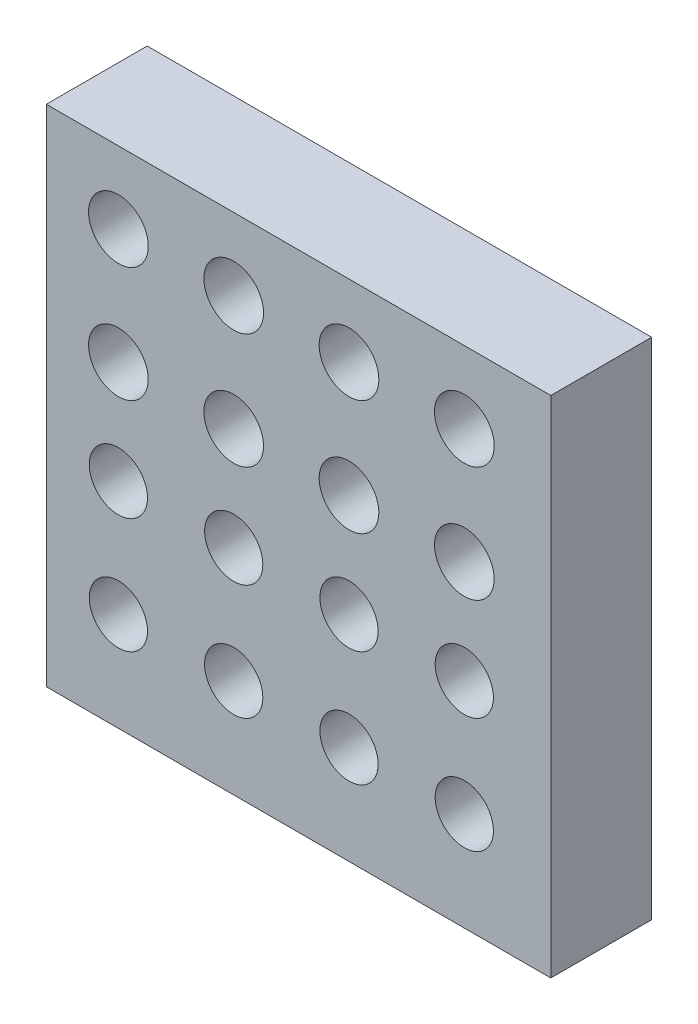
ISO-10303-21;
HEADER;
FILE_DESCRIPTION(('STEP AP214'),'2;1');
FILE_NAME('part.step','',(''),(''),'','','');
FILE_SCHEMA(('AUTOMOTIVE_DESIGN { 1 0 10303 214 1 1 1 1 }'));
ENDSEC;
DATA;
#1=APPLICATION_CONTEXT('core data for automotive mechanical design processes');
#2=APPLICATION_PROTOCOL_DEFINITION('international standard','automotive_design',2000,#1);
#3=PRODUCT_CONTEXT('',#1,'mechanical');
#4=PRODUCT('Part','Part','',(#3));
#5=PRODUCT_RELATED_PRODUCT_CATEGORY('part','',(#4));
#6=PRODUCT_DEFINITION_FORMATION('','',#4);
#7=PRODUCT_DEFINITION_CONTEXT('part definition',#1,'design');
#8=PRODUCT_DEFINITION('design','',#6,#7);
#9=PRODUCT_DEFINITION_SHAPE('','',#8);
#10=(LENGTH_UNIT() NAMED_UNIT(*) SI_UNIT(.MILLI.,.METRE.));
#11=(NAMED_UNIT(*) PLANE_ANGLE_UNIT() SI_UNIT($,.RADIAN.));
#12=(NAMED_UNIT(*) SI_UNIT($,.STERADIAN.) SOLID_ANGLE_UNIT());
#13=UNCERTAINTY_MEASURE_WITH_UNIT(LENGTH_MEASURE(1.E-05),#10,'distance_accuracy_value','');
#14=(GEOMETRIC_REPRESENTATION_CONTEXT(3) GLOBAL_UNCERTAINTY_ASSIGNED_CONTEXT((#13)) GLOBAL_UNIT_ASSIGNED_CONTEXT((#10,
#11,#12)) REPRESENTATION_CONTEXT('',''));
#15=CARTESIAN_POINT('',(0.,0.,0.));
#16=DIRECTION('',(0.,0.,1.));
#17=DIRECTION('',(1.,0.,0.));
#18=AXIS2_PLACEMENT_3D('',#15,#16,#17);
#19=CARTESIAN_POINT('',(0.,0.,7.));
#20=DIRECTION('',(1.,0.,0.));
#21=DIRECTION('',(0.,1.,0.));
#22=AXIS2_PLACEMENT_3D('',#19,#20,#21);
#23=PLANE('',#22);
#24=DIRECTION('',(0.,-1.,0.));
#25=VECTOR('',#24,1.);
#26=CARTESIAN_POINT('',(0.,0.,0.));
#27=LINE('',#26,#25);
#28=CARTESIAN_POINT('',(0.,0.,0.));
#29=VERTEX_POINT('',#28);
#30=CARTESIAN_POINT('',(0.,-35.,0.));
#31=VERTEX_POINT('',#30);
#32=EDGE_CURVE('E113',#29,#31,#27,.T.);
#33=ORIENTED_EDGE('',*,*,#32,.T.);
#34=DIRECTION('',(0.,0.,-1.));
#35=VECTOR('',#34,1.);
#36=CARTESIAN_POINT('',(0.,-35.,7.));
#37=LINE('',#36,#35);
#38=CARTESIAN_POINT('',(0.,-35.,7.));
#39=VERTEX_POINT('',#38);
#40=EDGE_CURVE('E11',#39,#31,#37,.T.);
#41=ORIENTED_EDGE('',*,*,#40,.F.);
#42=DIRECTION('',(0.,-1.,0.));
#43=VECTOR('',#42,1.);
#44=CARTESIAN_POINT('',(0.,0.,7.));
#45=LINE('',#44,#43);
#46=CARTESIAN_POINT('',(0.,0.,7.));
#47=VERTEX_POINT('',#46);
#48=EDGE_CURVE('E97',#47,#39,#45,.T.);
#49=ORIENTED_EDGE('',*,*,#48,.F.);
#50=DIRECTION('',(0.,0.,-1.));
#51=VECTOR('',#50,1.);
#52=CARTESIAN_POINT('',(0.,0.,7.));
#53=LINE('',#52,#51);
#54=EDGE_CURVE('E109',#47,#29,#53,.T.);
#55=ORIENTED_EDGE('',*,*,#54,.T.);
#56=EDGE_LOOP('',(#33,#41,#49,#55));
#57=FACE_BOUND('',#56,.T.);
#58=ADVANCED_FACE('F45',(#57),#23,.F.);
#59=CARTESIAN_POINT('',(0.,-35.,7.));
#60=DIRECTION('',(0.,1.,0.));
#61=DIRECTION('',(0.,0.,1.));
#62=AXIS2_PLACEMENT_3D('',#59,#60,#61);
#63=PLANE('',#62);
#64=DIRECTION('',(1.,0.,0.));
#65=VECTOR('',#64,1.);
#66=CARTESIAN_POINT('',(0.,-35.,0.));
#67=LINE('',#66,#65);
#68=CARTESIAN_POINT('',(35.,-35.,0.));
#69=VERTEX_POINT('',#68);
#70=EDGE_CURVE('E102',#31,#69,#67,.T.);
#71=ORIENTED_EDGE('',*,*,#70,.T.);
#72=DIRECTION('',(0.,0.,-1.));
#73=VECTOR('',#72,1.);
#74=CARTESIAN_POINT('',(35.,-35.,7.));
#75=LINE('',#74,#73);
#76=CARTESIAN_POINT('',(35.,-35.,7.));
#77=VERTEX_POINT('',#76);
#78=EDGE_CURVE('E54',#77,#69,#75,.T.);
#79=ORIENTED_EDGE('',*,*,#78,.F.);
#80=DIRECTION('',(1.,0.,0.));
#81=VECTOR('',#80,1.);
#82=CARTESIAN_POINT('',(0.,-35.,7.));
#83=LINE('',#82,#81);
#84=EDGE_CURVE('E92',#39,#77,#83,.T.);
#85=ORIENTED_EDGE('',*,*,#84,.F.);
#86=ORIENTED_EDGE('',*,*,#40,.T.);
#87=EDGE_LOOP('',(#71,#79,#85,#86));
#88=FACE_BOUND('',#87,.T.);
#89=ADVANCED_FACE('F101',(#88),#63,.F.);
#90=CARTESIAN_POINT('',(35.,0.,7.));
#91=DIRECTION('',(-1.,0.,0.));
#92=DIRECTION('',(0.,-1.,0.));
#93=AXIS2_PLACEMENT_3D('',#90,#91,#92);
#94=PLANE('',#93);
#95=DIRECTION('',(0.,1.,0.));
#96=VECTOR('',#95,1.);
#97=CARTESIAN_POINT('',(35.,0.,0.));
#98=LINE('',#97,#96);
#99=CARTESIAN_POINT('',(35.,0.,0.));
#100=VERTEX_POINT('',#99);
#101=EDGE_CURVE('E79',#69,#100,#98,.T.);
#102=ORIENTED_EDGE('',*,*,#101,.T.);
#103=DIRECTION('',(0.,0.,-1.));
#104=VECTOR('',#103,1.);
#105=CARTESIAN_POINT('',(35.,0.,7.));
#106=LINE('',#105,#104);
#107=CARTESIAN_POINT('',(35.,0.,7.));
#108=VERTEX_POINT('',#107);
#109=EDGE_CURVE('E104',#108,#100,#106,.T.);
#110=ORIENTED_EDGE('',*,*,#109,.F.);
#111=DIRECTION('',(0.,1.,0.));
#112=VECTOR('',#111,1.);
#113=CARTESIAN_POINT('',(35.,0.,7.));
#114=LINE('',#113,#112);
#115=EDGE_CURVE('E95',#77,#108,#114,.T.);
#116=ORIENTED_EDGE('',*,*,#115,.F.);
#117=ORIENTED_EDGE('',*,*,#78,.T.);
#118=EDGE_LOOP('',(#102,#110,#116,#117));
#119=FACE_BOUND('',#118,.T.);
#120=ADVANCED_FACE('F105',(#119),#94,.F.);
#121=CARTESIAN_POINT('',(0.,0.,7.));
#122=DIRECTION('',(0.,-1.,0.));
#123=DIRECTION('',(0.,0.,-1.));
#124=AXIS2_PLACEMENT_3D('',#121,#122,#123);
#125=PLANE('',#124);
#126=DIRECTION('',(-1.,0.,0.));
#127=VECTOR('',#126,1.);
#128=CARTESIAN_POINT('',(0.,0.,0.));
#129=LINE('',#128,#127);
#130=EDGE_CURVE('E85',#100,#29,#129,.T.);
#131=ORIENTED_EDGE('',*,*,#130,.T.);
#132=ORIENTED_EDGE('',*,*,#54,.F.);
#133=DIRECTION('',(-1.,0.,0.));
#134=VECTOR('',#133,1.);
#135=CARTESIAN_POINT('',(0.,0.,7.));
#136=LINE('',#135,#134);
#137=EDGE_CURVE('E62',#108,#47,#136,.T.);
#138=ORIENTED_EDGE('',*,*,#137,.F.);
#139=ORIENTED_EDGE('',*,*,#109,.T.);
#140=EDGE_LOOP('',(#131,#132,#138,#139));
#141=FACE_BOUND('',#140,.T.);
#142=ADVANCED_FACE('F127',(#141),#125,.F.);
#143=CARTESIAN_POINT('',(0.,0.,7.));
#144=DIRECTION('',(0.,0.,1.));
#145=DIRECTION('',(1.,0.,0.));
#146=AXIS2_PLACEMENT_3D('',#143,#144,#145);
#147=PLANE('',#146);
#148=CARTESIAN_POINT('',(13.0000000000001,-13.,7.));
#149=DIRECTION('',(0.,0.,1.));
#150=DIRECTION('',(1.,0.,0.));
#151=AXIS2_PLACEMENT_3D('',#148,#149,#150);
#152=CIRCLE('',#151,2.07);
#153=CARTESIAN_POINT('',(15.0700000000001,-13.,7.));
#154=VERTEX_POINT('',#153);
#155=EDGE_CURVE('E147',#154,#154,#152,.T.);
#156=ORIENTED_EDGE('',*,*,#155,.F.);
#157=EDGE_LOOP('',(#156));
#158=FACE_BOUND('',#157,.T.);
#159=CARTESIAN_POINT('',(21.0000000000001,-13.,7.));
#160=DIRECTION('',(0.,0.,1.));
#161=DIRECTION('',(1.,0.,0.));
#162=AXIS2_PLACEMENT_3D('',#159,#160,#161);
#163=CIRCLE('',#162,2.07);
#164=CARTESIAN_POINT('',(23.0700000000001,-13.,7.));
#165=VERTEX_POINT('',#164);
#166=EDGE_CURVE('E178',#165,#165,#163,.T.);
#167=ORIENTED_EDGE('',*,*,#166,.F.);
#168=EDGE_LOOP('',(#167));
#169=FACE_BOUND('',#168,.T.);
#170=CARTESIAN_POINT('',(29.0000000000001,-13.,7.));
#171=DIRECTION('',(0.,0.,1.));
#172=DIRECTION('',(1.,0.,0.));
#173=AXIS2_PLACEMENT_3D('',#170,#171,#172);
#174=CIRCLE('',#173,2.07);
#175=CARTESIAN_POINT('',(31.0700000000001,-13.,7.));
#176=VERTEX_POINT('',#175);
#177=EDGE_CURVE('E179',#176,#176,#174,.T.);
#178=ORIENTED_EDGE('',*,*,#177,.F.);
#179=EDGE_LOOP('',(#178));
#180=FACE_BOUND('',#179,.T.);
#181=CARTESIAN_POINT('',(5.00000000000008,-20.1498357522851,7.));
#182=DIRECTION('',(0.,0.,1.));
#183=DIRECTION('',(1.,0.,0.));
#184=AXIS2_PLACEMENT_3D('',#181,#182,#183);
#185=CIRCLE('',#184,2.02);
#186=CARTESIAN_POINT('',(7.02000000000008,-20.1498357522851,7.));
#187=VERTEX_POINT('',#186);
#188=EDGE_CURVE('E194',#187,#187,#185,.T.);
#189=ORIENTED_EDGE('',*,*,#188,.F.);
#190=EDGE_LOOP('',(#189));
#191=FACE_BOUND('',#190,.T.);
#192=CARTESIAN_POINT('',(29.,-5.,7.));
#193=DIRECTION('',(0.,0.,1.));
#194=DIRECTION('',(1.,0.,0.));
#195=AXIS2_PLACEMENT_3D('',#192,#193,#194);
#196=CIRCLE('',#195,2.07);
#197=CARTESIAN_POINT('',(31.07,-5.,7.));
#198=VERTEX_POINT('',#197);
#199=EDGE_CURVE('E146',#198,#198,#196,.T.);
#200=ORIENTED_EDGE('',*,*,#199,.F.);
#201=EDGE_LOOP('',(#200));
#202=FACE_BOUND('',#201,.T.);
#203=CARTESIAN_POINT('',(21.,-5.,7.));
#204=DIRECTION('',(0.,0.,1.));
#205=DIRECTION('',(1.,0.,0.));
#206=AXIS2_PLACEMENT_3D('',#203,#204,#205);
#207=CIRCLE('',#206,2.07);
#208=CARTESIAN_POINT('',(23.07,-5.,7.));
#209=VERTEX_POINT('',#208);
#210=EDGE_CURVE('E155',#209,#209,#207,.T.);
#211=ORIENTED_EDGE('',*,*,#210,.F.);
#212=EDGE_LOOP('',(#211));
#213=FACE_BOUND('',#212,.T.);
#214=CARTESIAN_POINT('',(13.,-5.,7.));
#215=DIRECTION('',(0.,0.,1.));
#216=DIRECTION('',(1.,0.,0.));
#217=AXIS2_PLACEMENT_3D('',#214,#215,#216);
#218=CIRCLE('',#217,2.07);
#219=CARTESIAN_POINT('',(15.07,-5.,7.));
#220=VERTEX_POINT('',#219);
#221=EDGE_CURVE('E163',#220,#220,#218,.T.);
#222=ORIENTED_EDGE('',*,*,#221,.F.);
#223=EDGE_LOOP('',(#222));
#224=FACE_BOUND('',#223,.T.);
#225=CARTESIAN_POINT('',(5.00000000000008,-13.,7.));
#226=DIRECTION('',(0.,0.,1.));
#227=DIRECTION('',(1.,0.,0.));
#228=AXIS2_PLACEMENT_3D('',#225,#226,#227);
#229=CIRCLE('',#228,2.07);
#230=CARTESIAN_POINT('',(7.07000000000008,-13.,7.));
#231=VERTEX_POINT('',#230);
#232=EDGE_CURVE('E138',#231,#231,#229,.T.);
#233=ORIENTED_EDGE('',*,*,#232,.F.);
#234=EDGE_LOOP('',(#233));
#235=FACE_BOUND('',#234,.T.);
#236=CARTESIAN_POINT('',(5.00000000000017,-28.1498357522851,7.));
#237=DIRECTION('',(0.,0.,1.));
#238=DIRECTION('',(1.,0.,0.));
#239=AXIS2_PLACEMENT_3D('',#236,#237,#238);
#240=CIRCLE('',#239,2.02);
#241=CARTESIAN_POINT('',(7.02000000000017,-28.1498357522851,7.));
#242=VERTEX_POINT('',#241);
#243=EDGE_CURVE('E242',#242,#242,#240,.T.);
#244=ORIENTED_EDGE('',*,*,#243,.F.);
#245=EDGE_LOOP('',(#244));
#246=FACE_BOUND('',#245,.T.);
#247=CARTESIAN_POINT('',(29.0000000000002,-28.1498357522851,7.));
#248=DIRECTION('',(0.,0.,1.));
#249=DIRECTION('',(1.,0.,0.));
#250=AXIS2_PLACEMENT_3D('',#247,#248,#249);
#251=CIRCLE('',#250,2.02);
#252=CARTESIAN_POINT('',(31.0200000000002,-28.1498357522851,7.));
#253=VERTEX_POINT('',#252);
#254=EDGE_CURVE('E250',#253,#253,#251,.T.);
#255=ORIENTED_EDGE('',*,*,#254,.F.);
#256=EDGE_LOOP('',(#255));
#257=FACE_BOUND('',#256,.T.);
#258=CARTESIAN_POINT('',(21.0000000000002,-28.1498357522851,7.));
#259=DIRECTION('',(0.,0.,1.));
#260=DIRECTION('',(1.,0.,0.));
#261=AXIS2_PLACEMENT_3D('',#258,#259,#260);
#262=CIRCLE('',#261,2.02);
#263=CARTESIAN_POINT('',(23.0200000000002,-28.1498357522851,7.));
#264=VERTEX_POINT('',#263);
#265=EDGE_CURVE('E227',#264,#264,#262,.T.);
#266=ORIENTED_EDGE('',*,*,#265,.F.);
#267=EDGE_LOOP('',(#266));
#268=FACE_BOUND('',#267,.T.);
#269=CARTESIAN_POINT('',(13.0000000000001,-20.1498357522851,7.));
#270=DIRECTION('',(0.,0.,1.));
#271=DIRECTION('',(1.,0.,0.));
#272=AXIS2_PLACEMENT_3D('',#269,#270,#271);
#273=CIRCLE('',#272,2.02);
#274=CARTESIAN_POINT('',(15.0200000000001,-20.1498357522851,7.));
#275=VERTEX_POINT('',#274);
#276=EDGE_CURVE('E195',#275,#275,#273,.T.);
#277=ORIENTED_EDGE('',*,*,#276,.F.);
#278=EDGE_LOOP('',(#277));
#279=FACE_BOUND('',#278,.T.);
#280=CARTESIAN_POINT('',(21.0000000000001,-20.1498357522851,7.));
#281=DIRECTION('',(0.,0.,1.));
#282=DIRECTION('',(1.,0.,0.));
#283=AXIS2_PLACEMENT_3D('',#280,#281,#282);
#284=CIRCLE('',#283,2.02);
#285=CARTESIAN_POINT('',(23.0200000000001,-20.1498357522851,7.));
#286=VERTEX_POINT('',#285);
#287=EDGE_CURVE('E210',#286,#286,#284,.T.);
#288=ORIENTED_EDGE('',*,*,#287,.F.);
#289=EDGE_LOOP('',(#288));
#290=FACE_BOUND('',#289,.T.);
#291=CARTESIAN_POINT('',(29.0000000000001,-20.1498357522851,7.));
#292=DIRECTION('',(0.,0.,1.));
#293=DIRECTION('',(1.,0.,0.));
#294=AXIS2_PLACEMENT_3D('',#291,#292,#293);
#295=CIRCLE('',#294,2.02);
#296=CARTESIAN_POINT('',(31.0200000000001,-20.1498357522851,7.));
#297=VERTEX_POINT('',#296);
#298=EDGE_CURVE('E211',#297,#297,#295,.T.);
#299=ORIENTED_EDGE('',*,*,#298,.F.);
#300=EDGE_LOOP('',(#299));
#301=FACE_BOUND('',#300,.T.);
#302=CARTESIAN_POINT('',(13.0000000000002,-28.1498357522851,7.));
#303=DIRECTION('',(0.,0.,1.));
#304=DIRECTION('',(1.,0.,0.));
#305=AXIS2_PLACEMENT_3D('',#302,#303,#304);
#306=CIRCLE('',#305,2.02);
#307=CARTESIAN_POINT('',(15.0200000000002,-28.1498357522851,7.));
#308=VERTEX_POINT('',#307);
#309=EDGE_CURVE('E226',#308,#308,#306,.T.);
#310=ORIENTED_EDGE('',*,*,#309,.F.);
#311=EDGE_LOOP('',(#310));
#312=FACE_BOUND('',#311,.T.);
#313=CARTESIAN_POINT('',(5.,-5.,7.));
#314=DIRECTION('',(0.,0.,1.));
#315=DIRECTION('',(1.,0.,0.));
#316=AXIS2_PLACEMENT_3D('',#313,#314,#315);
#317=CIRCLE('',#316,2.07);
#318=CARTESIAN_POINT('',(7.07,-5.,7.));
#319=VERTEX_POINT('',#318);
#320=EDGE_CURVE('E134',#319,#319,#317,.T.);
#321=ORIENTED_EDGE('',*,*,#320,.F.);
#322=EDGE_LOOP('',(#321));
#323=FACE_BOUND('',#322,.T.);
#324=ORIENTED_EDGE('',*,*,#48,.T.);
#325=ORIENTED_EDGE('',*,*,#84,.T.);
#326=ORIENTED_EDGE('',*,*,#115,.T.);
#327=ORIENTED_EDGE('',*,*,#137,.T.);
#328=EDGE_LOOP('',(#324,#325,#326,#327));
#329=FACE_BOUND('',#328,.T.);
#330=ADVANCED_FACE('F93',(#158,#169,#180,#191,#202,#213,#224,#235,#246,#257,#268,#279,#290,#301,
#312,#323,#329),#147,.T.);
#331=CARTESIAN_POINT('',(0.,0.,0.));
#332=DIRECTION('',(0.,0.,1.));
#333=DIRECTION('',(1.,0.,0.));
#334=AXIS2_PLACEMENT_3D('',#331,#332,#333);
#335=PLANE('',#334);
#336=ORIENTED_EDGE('',*,*,#32,.F.);
#337=ORIENTED_EDGE('',*,*,#130,.F.);
#338=ORIENTED_EDGE('',*,*,#101,.F.);
#339=ORIENTED_EDGE('',*,*,#70,.F.);
#340=EDGE_LOOP('',(#336,#337,#338,#339));
#341=FACE_BOUND('',#340,.T.);
#342=ADVANCED_FACE('F130',(#341),#335,.F.);
#343=CARTESIAN_POINT('',(5.,-5.,2.));
#344=DIRECTION('',(0.,0.,1.));
#345=DIRECTION('',(1.,0.,0.));
#346=AXIS2_PLACEMENT_3D('',#343,#344,#345);
#347=CYLINDRICAL_SURFACE('',#346,2.07);
#348=CARTESIAN_POINT('',(5.,-5.,2.));
#349=DIRECTION('',(0.,0.,1.));
#350=DIRECTION('',(1.,0.,0.));
#351=AXIS2_PLACEMENT_3D('',#348,#349,#350);
#352=CIRCLE('',#351,2.07);
#353=CARTESIAN_POINT('',(7.07,-5.,2.));
#354=VERTEX_POINT('',#353);
#355=EDGE_CURVE('E117',#354,#354,#352,.T.);
#356=ORIENTED_EDGE('',*,*,#355,.F.);
#357=EDGE_LOOP('',(#356));
#358=FACE_BOUND('',#357,.T.);
#359=ORIENTED_EDGE('',*,*,#320,.T.);
#360=EDGE_LOOP('',(#359));
#361=FACE_BOUND('',#360,.T.);
#362=ADVANCED_FACE('F278',(#358,#361),#347,.F.);
#363=CARTESIAN_POINT('',(5.,-5.,2.));
#364=DIRECTION('',(0.,0.,1.));
#365=DIRECTION('',(1.,0.,0.));
#366=AXIS2_PLACEMENT_3D('',#363,#364,#365);
#367=PLANE('',#366);
#368=ORIENTED_EDGE('',*,*,#355,.T.);
#369=EDGE_LOOP('',(#368));
#370=FACE_BOUND('',#369,.T.);
#371=ADVANCED_FACE('F280',(#370),#367,.T.);
#372=CARTESIAN_POINT('',(13.0000000000002,-28.1498357522851,2.));
#373=DIRECTION('',(0.,0.,1.));
#374=DIRECTION('',(1.,0.,0.));
#375=AXIS2_PLACEMENT_3D('',#372,#373,#374);
#376=CYLINDRICAL_SURFACE('',#375,2.02);
#377=CARTESIAN_POINT('',(13.0000000000002,-28.1498357522851,2.));
#378=DIRECTION('',(0.,0.,1.));
#379=DIRECTION('',(1.,0.,0.));
#380=AXIS2_PLACEMENT_3D('',#377,#378,#379);
#381=CIRCLE('',#380,2.02);
#382=CARTESIAN_POINT('',(15.0200000000002,-28.1498357522851,2.));
#383=VERTEX_POINT('',#382);
#384=EDGE_CURVE('E222',#383,#383,#381,.T.);
#385=ORIENTED_EDGE('',*,*,#384,.F.);
#386=EDGE_LOOP('',(#385));
#387=FACE_BOUND('',#386,.T.);
#388=ORIENTED_EDGE('',*,*,#309,.T.);
#389=EDGE_LOOP('',(#388));
#390=FACE_BOUND('',#389,.T.);
#391=ADVANCED_FACE('F286',(#387,#390),#376,.F.);
#392=CARTESIAN_POINT('',(13.0000000000002,-28.1498357522851,2.));
#393=DIRECTION('',(0.,0.,1.));
#394=DIRECTION('',(1.,0.,0.));
#395=AXIS2_PLACEMENT_3D('',#392,#393,#394);
#396=PLANE('',#395);
#397=ORIENTED_EDGE('',*,*,#384,.T.);
#398=EDGE_LOOP('',(#397));
#399=FACE_BOUND('',#398,.T.);
#400=ADVANCED_FACE('F337',(#399),#396,.T.);
#401=CARTESIAN_POINT('',(29.0000000000001,-20.1498357522851,2.));
#402=DIRECTION('',(0.,0.,1.));
#403=DIRECTION('',(1.,0.,0.));
#404=AXIS2_PLACEMENT_3D('',#401,#402,#403);
#405=CYLINDRICAL_SURFACE('',#404,2.02);
#406=CARTESIAN_POINT('',(29.0000000000001,-20.1498357522851,2.));
#407=DIRECTION('',(0.,0.,1.));
#408=DIRECTION('',(1.,0.,0.));
#409=AXIS2_PLACEMENT_3D('',#406,#407,#408);
#410=CIRCLE('',#409,2.02);
#411=CARTESIAN_POINT('',(31.0200000000001,-20.1498357522851,2.));
#412=VERTEX_POINT('',#411);
#413=EDGE_CURVE('E231',#412,#412,#410,.T.);
#414=ORIENTED_EDGE('',*,*,#413,.F.);
#415=EDGE_LOOP('',(#414));
#416=FACE_BOUND('',#415,.T.);
#417=ORIENTED_EDGE('',*,*,#298,.T.);
#418=EDGE_LOOP('',(#417));
#419=FACE_BOUND('',#418,.T.);
#420=ADVANCED_FACE('F346',(#416,#419),#405,.F.);
#421=CARTESIAN_POINT('',(29.0000000000001,-20.1498357522851,2.));
#422=DIRECTION('',(0.,0.,1.));
#423=DIRECTION('',(1.,0.,0.));
#424=AXIS2_PLACEMENT_3D('',#421,#422,#423);
#425=PLANE('',#424);
#426=ORIENTED_EDGE('',*,*,#413,.T.);
#427=EDGE_LOOP('',(#426));
#428=FACE_BOUND('',#427,.T.);
#429=ADVANCED_FACE('F355',(#428),#425,.T.);
#430=CARTESIAN_POINT('',(21.0000000000001,-20.1498357522851,2.));
#431=DIRECTION('',(0.,0.,1.));
#432=DIRECTION('',(1.,0.,0.));
#433=AXIS2_PLACEMENT_3D('',#430,#431,#432);
#434=CYLINDRICAL_SURFACE('',#433,2.02);
#435=CARTESIAN_POINT('',(21.0000000000001,-20.1498357522851,2.));
#436=DIRECTION('',(0.,0.,1.));
#437=DIRECTION('',(1.,0.,0.));
#438=AXIS2_PLACEMENT_3D('',#435,#436,#437);
#439=CIRCLE('',#438,2.02);
#440=CARTESIAN_POINT('',(23.0200000000001,-20.1498357522851,2.));
#441=VERTEX_POINT('',#440);
#442=EDGE_CURVE('E206',#441,#441,#439,.T.);
#443=ORIENTED_EDGE('',*,*,#442,.F.);
#444=EDGE_LOOP('',(#443));
#445=FACE_BOUND('',#444,.T.);
#446=ORIENTED_EDGE('',*,*,#287,.T.);
#447=EDGE_LOOP('',(#446));
#448=FACE_BOUND('',#447,.T.);
#449=ADVANCED_FACE('F364',(#445,#448),#434,.F.);
#450=CARTESIAN_POINT('',(21.0000000000001,-20.1498357522851,2.));
#451=DIRECTION('',(0.,0.,1.));
#452=DIRECTION('',(1.,0.,0.));
#453=AXIS2_PLACEMENT_3D('',#450,#451,#452);
#454=PLANE('',#453);
#455=ORIENTED_EDGE('',*,*,#442,.T.);
#456=EDGE_LOOP('',(#455));
#457=FACE_BOUND('',#456,.T.);
#458=ADVANCED_FACE('F373',(#457),#454,.T.);
#459=CARTESIAN_POINT('',(13.0000000000001,-20.1498357522851,2.));
#460=DIRECTION('',(0.,0.,1.));
#461=DIRECTION('',(1.,0.,0.));
#462=AXIS2_PLACEMENT_3D('',#459,#460,#461);
#463=CYLINDRICAL_SURFACE('',#462,2.02);
#464=CARTESIAN_POINT('',(13.0000000000001,-20.1498357522851,2.));
#465=DIRECTION('',(0.,0.,1.));
#466=DIRECTION('',(1.,0.,0.));
#467=AXIS2_PLACEMENT_3D('',#464,#465,#466);
#468=CIRCLE('',#467,2.02);
#469=CARTESIAN_POINT('',(15.0200000000001,-20.1498357522851,2.));
#470=VERTEX_POINT('',#469);
#471=EDGE_CURVE('E215',#470,#470,#468,.T.);
#472=ORIENTED_EDGE('',*,*,#471,.F.);
#473=EDGE_LOOP('',(#472));
#474=FACE_BOUND('',#473,.T.);
#475=ORIENTED_EDGE('',*,*,#276,.T.);
#476=EDGE_LOOP('',(#475));
#477=FACE_BOUND('',#476,.T.);
#478=ADVANCED_FACE('F382',(#474,#477),#463,.F.);
#479=CARTESIAN_POINT('',(13.0000000000001,-20.1498357522851,2.));
#480=DIRECTION('',(0.,0.,1.));
#481=DIRECTION('',(1.,0.,0.));
#482=AXIS2_PLACEMENT_3D('',#479,#480,#481);
#483=PLANE('',#482);
#484=ORIENTED_EDGE('',*,*,#471,.T.);
#485=EDGE_LOOP('',(#484));
#486=FACE_BOUND('',#485,.T.);
#487=ADVANCED_FACE('F391',(#486),#483,.T.);
#488=CARTESIAN_POINT('',(21.0000000000002,-28.1498357522851,2.));
#489=DIRECTION('',(0.,0.,1.));
#490=DIRECTION('',(1.,0.,0.));
#491=AXIS2_PLACEMENT_3D('',#488,#489,#490);
#492=CYLINDRICAL_SURFACE('',#491,2.02);
#493=CARTESIAN_POINT('',(21.0000000000002,-28.1498357522851,2.));
#494=DIRECTION('',(0.,0.,1.));
#495=DIRECTION('',(1.,0.,0.));
#496=AXIS2_PLACEMENT_3D('',#493,#494,#495);
#497=CIRCLE('',#496,2.02);
#498=CARTESIAN_POINT('',(23.0200000000002,-28.1498357522851,2.));
#499=VERTEX_POINT('',#498);
#500=EDGE_CURVE('E254',#499,#499,#497,.T.);
#501=ORIENTED_EDGE('',*,*,#500,.F.);
#502=EDGE_LOOP('',(#501));
#503=FACE_BOUND('',#502,.T.);
#504=ORIENTED_EDGE('',*,*,#265,.T.);
#505=EDGE_LOOP('',(#504));
#506=FACE_BOUND('',#505,.T.);
#507=ADVANCED_FACE('F262',(#503,#506),#492,.F.);
#508=CARTESIAN_POINT('',(21.0000000000002,-28.1498357522851,2.));
#509=DIRECTION('',(0.,0.,1.));
#510=DIRECTION('',(1.,0.,0.));
#511=AXIS2_PLACEMENT_3D('',#508,#509,#510);
#512=PLANE('',#511);
#513=ORIENTED_EDGE('',*,*,#500,.T.);
#514=EDGE_LOOP('',(#513));
#515=FACE_BOUND('',#514,.T.);
#516=ADVANCED_FACE('F408',(#515),#512,.T.);
#517=CARTESIAN_POINT('',(29.0000000000002,-28.1498357522851,2.));
#518=DIRECTION('',(0.,0.,1.));
#519=DIRECTION('',(1.,0.,0.));
#520=AXIS2_PLACEMENT_3D('',#517,#518,#519);
#521=CYLINDRICAL_SURFACE('',#520,2.02);
#522=CARTESIAN_POINT('',(29.0000000000002,-28.1498357522851,2.));
#523=DIRECTION('',(0.,0.,1.));
#524=DIRECTION('',(1.,0.,0.));
#525=AXIS2_PLACEMENT_3D('',#522,#523,#524);
#526=CIRCLE('',#525,2.02);
#527=CARTESIAN_POINT('',(31.0200000000002,-28.1498357522851,2.));
#528=VERTEX_POINT('',#527);
#529=EDGE_CURVE('E246',#528,#528,#526,.T.);
#530=ORIENTED_EDGE('',*,*,#529,.F.);
#531=EDGE_LOOP('',(#530));
#532=FACE_BOUND('',#531,.T.);
#533=ORIENTED_EDGE('',*,*,#254,.T.);
#534=EDGE_LOOP('',(#533));
#535=FACE_BOUND('',#534,.T.);
#536=ADVANCED_FACE('F417',(#532,#535),#521,.F.);
#537=CARTESIAN_POINT('',(29.0000000000002,-28.1498357522851,2.));
#538=DIRECTION('',(0.,0.,1.));
#539=DIRECTION('',(1.,0.,0.));
#540=AXIS2_PLACEMENT_3D('',#537,#538,#539);
#541=PLANE('',#540);
#542=ORIENTED_EDGE('',*,*,#529,.T.);
#543=EDGE_LOOP('',(#542));
#544=FACE_BOUND('',#543,.T.);
#545=ADVANCED_FACE('F426',(#544),#541,.T.);
#546=CARTESIAN_POINT('',(5.00000000000017,-28.1498357522851,2.));
#547=DIRECTION('',(0.,0.,1.));
#548=DIRECTION('',(1.,0.,0.));
#549=AXIS2_PLACEMENT_3D('',#546,#547,#548);
#550=CYLINDRICAL_SURFACE('',#549,2.02);
#551=CARTESIAN_POINT('',(5.00000000000017,-28.1498357522851,2.));
#552=DIRECTION('',(0.,0.,1.));
#553=DIRECTION('',(1.,0.,0.));
#554=AXIS2_PLACEMENT_3D('',#551,#552,#553);
#555=CIRCLE('',#554,2.02);
#556=CARTESIAN_POINT('',(7.02000000000017,-28.1498357522851,2.));
#557=VERTEX_POINT('',#556);
#558=EDGE_CURVE('E238',#557,#557,#555,.T.);
#559=ORIENTED_EDGE('',*,*,#558,.F.);
#560=EDGE_LOOP('',(#559));
#561=FACE_BOUND('',#560,.T.);
#562=ORIENTED_EDGE('',*,*,#243,.T.);
#563=EDGE_LOOP('',(#562));
#564=FACE_BOUND('',#563,.T.);
#565=ADVANCED_FACE('F435',(#561,#564),#550,.F.);
#566=CARTESIAN_POINT('',(5.00000000000017,-28.1498357522851,2.));
#567=DIRECTION('',(0.,0.,1.));
#568=DIRECTION('',(1.,0.,0.));
#569=AXIS2_PLACEMENT_3D('',#566,#567,#568);
#570=PLANE('',#569);
#571=ORIENTED_EDGE('',*,*,#558,.T.);
#572=EDGE_LOOP('',(#571));
#573=FACE_BOUND('',#572,.T.);
#574=ADVANCED_FACE('F444',(#573),#570,.T.);
#575=CARTESIAN_POINT('',(5.00000000000008,-13.,2.));
#576=DIRECTION('',(0.,0.,1.));
#577=DIRECTION('',(1.,0.,0.));
#578=AXIS2_PLACEMENT_3D('',#575,#576,#577);
#579=CYLINDRICAL_SURFACE('',#578,2.07);
#580=CARTESIAN_POINT('',(5.00000000000008,-13.,2.));
#581=DIRECTION('',(0.,0.,1.));
#582=DIRECTION('',(1.,0.,0.));
#583=AXIS2_PLACEMENT_3D('',#580,#581,#582);
#584=CIRCLE('',#583,2.07);
#585=CARTESIAN_POINT('',(7.07000000000008,-13.,2.));
#586=VERTEX_POINT('',#585);
#587=EDGE_CURVE('E167',#586,#586,#584,.T.);
#588=ORIENTED_EDGE('',*,*,#587,.F.);
#589=EDGE_LOOP('',(#588));
#590=FACE_BOUND('',#589,.T.);
#591=ORIENTED_EDGE('',*,*,#232,.T.);
#592=EDGE_LOOP('',(#591));
#593=FACE_BOUND('',#592,.T.);
#594=ADVANCED_FACE('F453',(#590,#593),#579,.F.);
#595=CARTESIAN_POINT('',(5.00000000000008,-13.,2.));
#596=DIRECTION('',(0.,0.,1.));
#597=DIRECTION('',(1.,0.,0.));
#598=AXIS2_PLACEMENT_3D('',#595,#596,#597);
#599=PLANE('',#598);
#600=ORIENTED_EDGE('',*,*,#587,.T.);
#601=EDGE_LOOP('',(#600));
#602=FACE_BOUND('',#601,.T.);
#603=ADVANCED_FACE('F462',(#602),#599,.T.);
#604=CARTESIAN_POINT('',(13.,-5.,2.));
#605=DIRECTION('',(0.,0.,1.));
#606=DIRECTION('',(1.,0.,0.));
#607=AXIS2_PLACEMENT_3D('',#604,#605,#606);
#608=CYLINDRICAL_SURFACE('',#607,2.07);
#609=CARTESIAN_POINT('',(13.,-5.,2.));
#610=DIRECTION('',(0.,0.,1.));
#611=DIRECTION('',(1.,0.,0.));
#612=AXIS2_PLACEMENT_3D('',#609,#610,#611);
#613=CIRCLE('',#612,2.07);
#614=CARTESIAN_POINT('',(15.07,-5.,2.));
#615=VERTEX_POINT('',#614);
#616=EDGE_CURVE('E159',#615,#615,#613,.T.);
#617=ORIENTED_EDGE('',*,*,#616,.F.);
#618=EDGE_LOOP('',(#617));
#619=FACE_BOUND('',#618,.T.);
#620=ORIENTED_EDGE('',*,*,#221,.T.);
#621=EDGE_LOOP('',(#620));
#622=FACE_BOUND('',#621,.T.);
#623=ADVANCED_FACE('F471',(#619,#622),#608,.F.);
#624=CARTESIAN_POINT('',(13.,-5.,2.));
#625=DIRECTION('',(0.,0.,1.));
#626=DIRECTION('',(1.,0.,0.));
#627=AXIS2_PLACEMENT_3D('',#624,#625,#626);
#628=PLANE('',#627);
#629=ORIENTED_EDGE('',*,*,#616,.T.);
#630=EDGE_LOOP('',(#629));
#631=FACE_BOUND('',#630,.T.);
#632=ADVANCED_FACE('F480',(#631),#628,.T.);
#633=CARTESIAN_POINT('',(21.,-5.,2.));
#634=DIRECTION('',(0.,0.,1.));
#635=DIRECTION('',(1.,0.,0.));
#636=AXIS2_PLACEMENT_3D('',#633,#634,#635);
#637=CYLINDRICAL_SURFACE('',#636,2.07);
#638=CARTESIAN_POINT('',(21.,-5.,2.));
#639=DIRECTION('',(0.,0.,1.));
#640=DIRECTION('',(1.,0.,0.));
#641=AXIS2_PLACEMENT_3D('',#638,#639,#640);
#642=CIRCLE('',#641,2.07);
#643=CARTESIAN_POINT('',(23.07,-5.,2.));
#644=VERTEX_POINT('',#643);
#645=EDGE_CURVE('E151',#644,#644,#642,.T.);
#646=ORIENTED_EDGE('',*,*,#645,.F.);
#647=EDGE_LOOP('',(#646));
#648=FACE_BOUND('',#647,.T.);
#649=ORIENTED_EDGE('',*,*,#210,.T.);
#650=EDGE_LOOP('',(#649));
#651=FACE_BOUND('',#650,.T.);
#652=ADVANCED_FACE('F489',(#648,#651),#637,.F.);
#653=CARTESIAN_POINT('',(21.,-5.,2.));
#654=DIRECTION('',(0.,0.,1.));
#655=DIRECTION('',(1.,0.,0.));
#656=AXIS2_PLACEMENT_3D('',#653,#654,#655);
#657=PLANE('',#656);
#658=ORIENTED_EDGE('',*,*,#645,.T.);
#659=EDGE_LOOP('',(#658));
#660=FACE_BOUND('',#659,.T.);
#661=ADVANCED_FACE('F498',(#660),#657,.T.);
#662=CARTESIAN_POINT('',(29.,-5.,2.));
#663=DIRECTION('',(0.,0.,1.));
#664=DIRECTION('',(1.,0.,0.));
#665=AXIS2_PLACEMENT_3D('',#662,#663,#664);
#666=CYLINDRICAL_SURFACE('',#665,2.07);
#667=CARTESIAN_POINT('',(29.,-5.,2.));
#668=DIRECTION('',(0.,0.,1.));
#669=DIRECTION('',(1.,0.,0.));
#670=AXIS2_PLACEMENT_3D('',#667,#668,#669);
#671=CIRCLE('',#670,2.07);
#672=CARTESIAN_POINT('',(31.07,-5.,2.));
#673=VERTEX_POINT('',#672);
#674=EDGE_CURVE('E142',#673,#673,#671,.T.);
#675=ORIENTED_EDGE('',*,*,#674,.F.);
#676=EDGE_LOOP('',(#675));
#677=FACE_BOUND('',#676,.T.);
#678=ORIENTED_EDGE('',*,*,#199,.T.);
#679=EDGE_LOOP('',(#678));
#680=FACE_BOUND('',#679,.T.);
#681=ADVANCED_FACE('F507',(#677,#680),#666,.F.);
#682=CARTESIAN_POINT('',(29.,-5.,2.));
#683=DIRECTION('',(0.,0.,1.));
#684=DIRECTION('',(1.,0.,0.));
#685=AXIS2_PLACEMENT_3D('',#682,#683,#684);
#686=PLANE('',#685);
#687=ORIENTED_EDGE('',*,*,#674,.T.);
#688=EDGE_LOOP('',(#687));
#689=FACE_BOUND('',#688,.T.);
#690=ADVANCED_FACE('F516',(#689),#686,.T.);
#691=CARTESIAN_POINT('',(5.00000000000008,-20.1498357522851,2.));
#692=DIRECTION('',(0.,0.,1.));
#693=DIRECTION('',(1.,0.,0.));
#694=AXIS2_PLACEMENT_3D('',#691,#692,#693);
#695=CYLINDRICAL_SURFACE('',#694,2.02);
#696=CARTESIAN_POINT('',(5.00000000000008,-20.1498357522851,2.));
#697=DIRECTION('',(0.,0.,1.));
#698=DIRECTION('',(1.,0.,0.));
#699=AXIS2_PLACEMENT_3D('',#696,#697,#698);
#700=CIRCLE('',#699,2.02);
#701=CARTESIAN_POINT('',(7.02000000000008,-20.1498357522851,2.));
#702=VERTEX_POINT('',#701);
#703=EDGE_CURVE('E190',#702,#702,#700,.T.);
#704=ORIENTED_EDGE('',*,*,#703,.F.);
#705=EDGE_LOOP('',(#704));
#706=FACE_BOUND('',#705,.T.);
#707=ORIENTED_EDGE('',*,*,#188,.T.);
#708=EDGE_LOOP('',(#707));
#709=FACE_BOUND('',#708,.T.);
#710=ADVANCED_FACE('F525',(#706,#709),#695,.F.);
#711=CARTESIAN_POINT('',(5.00000000000008,-20.1498357522851,2.));
#712=DIRECTION('',(0.,0.,1.));
#713=DIRECTION('',(1.,0.,0.));
#714=AXIS2_PLACEMENT_3D('',#711,#712,#713);
#715=PLANE('',#714);
#716=ORIENTED_EDGE('',*,*,#703,.T.);
#717=EDGE_LOOP('',(#716));
#718=FACE_BOUND('',#717,.T.);
#719=ADVANCED_FACE('F534',(#718),#715,.T.);
#720=CARTESIAN_POINT('',(29.0000000000001,-13.,2.));
#721=DIRECTION('',(0.,0.,1.));
#722=DIRECTION('',(1.,0.,0.));
#723=AXIS2_PLACEMENT_3D('',#720,#721,#722);
#724=CYLINDRICAL_SURFACE('',#723,2.07);
#725=CARTESIAN_POINT('',(29.0000000000001,-13.,2.));
#726=DIRECTION('',(0.,0.,1.));
#727=DIRECTION('',(1.,0.,0.));
#728=AXIS2_PLACEMENT_3D('',#725,#726,#727);
#729=CIRCLE('',#728,2.07);
#730=CARTESIAN_POINT('',(31.0700000000001,-13.,2.));
#731=VERTEX_POINT('',#730);
#732=EDGE_CURVE('E199',#731,#731,#729,.T.);
#733=ORIENTED_EDGE('',*,*,#732,.F.);
#734=EDGE_LOOP('',(#733));
#735=FACE_BOUND('',#734,.T.);
#736=ORIENTED_EDGE('',*,*,#177,.T.);
#737=EDGE_LOOP('',(#736));
#738=FACE_BOUND('',#737,.T.);
#739=ADVANCED_FACE('F543',(#735,#738),#724,.F.);
#740=CARTESIAN_POINT('',(29.0000000000001,-13.,2.));
#741=DIRECTION('',(0.,0.,1.));
#742=DIRECTION('',(1.,0.,0.));
#743=AXIS2_PLACEMENT_3D('',#740,#741,#742);
#744=PLANE('',#743);
#745=ORIENTED_EDGE('',*,*,#732,.T.);
#746=EDGE_LOOP('',(#745));
#747=FACE_BOUND('',#746,.T.);
#748=ADVANCED_FACE('F552',(#747),#744,.T.);
#749=CARTESIAN_POINT('',(21.0000000000001,-13.,2.));
#750=DIRECTION('',(0.,0.,1.));
#751=DIRECTION('',(1.,0.,0.));
#752=AXIS2_PLACEMENT_3D('',#749,#750,#751);
#753=CYLINDRICAL_SURFACE('',#752,2.07);
#754=CARTESIAN_POINT('',(21.0000000000001,-13.,2.));
#755=DIRECTION('',(0.,0.,1.));
#756=DIRECTION('',(1.,0.,0.));
#757=AXIS2_PLACEMENT_3D('',#754,#755,#756);
#758=CIRCLE('',#757,2.07);
#759=CARTESIAN_POINT('',(23.0700000000001,-13.,2.));
#760=VERTEX_POINT('',#759);
#761=EDGE_CURVE('E174',#760,#760,#758,.T.);
#762=ORIENTED_EDGE('',*,*,#761,.F.);
#763=EDGE_LOOP('',(#762));
#764=FACE_BOUND('',#763,.T.);
#765=ORIENTED_EDGE('',*,*,#166,.T.);
#766=EDGE_LOOP('',(#765));
#767=FACE_BOUND('',#766,.T.);
#768=ADVANCED_FACE('F561',(#764,#767),#753,.F.);
#769=CARTESIAN_POINT('',(21.0000000000001,-13.,2.));
#770=DIRECTION('',(0.,0.,1.));
#771=DIRECTION('',(1.,0.,0.));
#772=AXIS2_PLACEMENT_3D('',#769,#770,#771);
#773=PLANE('',#772);
#774=ORIENTED_EDGE('',*,*,#761,.T.);
#775=EDGE_LOOP('',(#774));
#776=FACE_BOUND('',#775,.T.);
#777=ADVANCED_FACE('F570',(#776),#773,.T.);
#778=CARTESIAN_POINT('',(13.0000000000001,-13.,2.));
#779=DIRECTION('',(0.,0.,1.));
#780=DIRECTION('',(1.,0.,0.));
#781=AXIS2_PLACEMENT_3D('',#778,#779,#780);
#782=CYLINDRICAL_SURFACE('',#781,2.07);
#783=CARTESIAN_POINT('',(13.0000000000001,-13.,2.));
#784=DIRECTION('',(0.,0.,1.));
#785=DIRECTION('',(1.,0.,0.));
#786=AXIS2_PLACEMENT_3D('',#783,#784,#785);
#787=CIRCLE('',#786,2.07);
#788=CARTESIAN_POINT('',(15.0700000000001,-13.,2.));
#789=VERTEX_POINT('',#788);
#790=EDGE_CURVE('E183',#789,#789,#787,.T.);
#791=ORIENTED_EDGE('',*,*,#790,.F.);
#792=EDGE_LOOP('',(#791));
#793=FACE_BOUND('',#792,.T.);
#794=ORIENTED_EDGE('',*,*,#155,.T.);
#795=EDGE_LOOP('',(#794));
#796=FACE_BOUND('',#795,.T.);
#797=ADVANCED_FACE('F579',(#793,#796),#782,.F.);
#798=CARTESIAN_POINT('',(13.0000000000001,-13.,2.));
#799=DIRECTION('',(0.,0.,1.));
#800=DIRECTION('',(1.,0.,0.));
#801=AXIS2_PLACEMENT_3D('',#798,#799,#800);
#802=PLANE('',#801);
#803=ORIENTED_EDGE('',*,*,#790,.T.);
#804=EDGE_LOOP('',(#803));
#805=FACE_BOUND('',#804,.T.);
#806=ADVANCED_FACE('F588',(#805),#802,.T.);
#807=CLOSED_SHELL('',(#58,#89,#120,#142,#330,#342,#362,#371,#391,#400,#420,#429,#449,#458,#478,
#487,#507,#516,#536,#545,#565,#574,#594,#603,#623,#632,#652,#661,#681,#690,#710,#719,#739,#748,
#768,#777,#797,#806));
#808=MANIFOLD_SOLID_BREP('B2',#807);
#809=ADVANCED_BREP_SHAPE_REPRESENTATION('',(#18,#808),#14);
#810=SHAPE_DEFINITION_REPRESENTATION(#9,#809);
ENDSEC;
END-ISO-10303-21;
